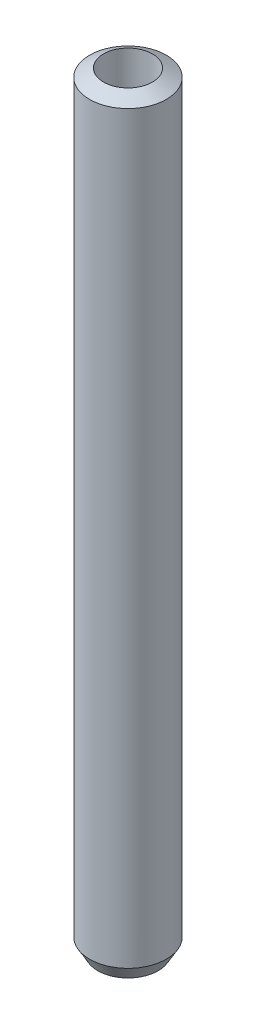
ISO-10303-21;
HEADER;
FILE_DESCRIPTION(('STEP AP214'),'2;1');
FILE_NAME('part.step','',(''),(''),'','','');
FILE_SCHEMA(('AUTOMOTIVE_DESIGN { 1 0 10303 214 1 1 1 1 }'));
ENDSEC;
DATA;
#1=APPLICATION_CONTEXT('core data for automotive mechanical design processes');
#2=APPLICATION_PROTOCOL_DEFINITION('international standard','automotive_design',2000,#1);
#3=PRODUCT_CONTEXT('',#1,'mechanical');
#4=PRODUCT('Part','Part','',(#3));
#5=PRODUCT_RELATED_PRODUCT_CATEGORY('part','',(#4));
#6=PRODUCT_DEFINITION_FORMATION('','',#4);
#7=PRODUCT_DEFINITION_CONTEXT('part definition',#1,'design');
#8=PRODUCT_DEFINITION('design','',#6,#7);
#9=PRODUCT_DEFINITION_SHAPE('','',#8);
#10=(LENGTH_UNIT() NAMED_UNIT(*) SI_UNIT(.MILLI.,.METRE.));
#11=(NAMED_UNIT(*) PLANE_ANGLE_UNIT() SI_UNIT($,.RADIAN.));
#12=(NAMED_UNIT(*) SI_UNIT($,.STERADIAN.) SOLID_ANGLE_UNIT());
#13=UNCERTAINTY_MEASURE_WITH_UNIT(LENGTH_MEASURE(1.E-05),#10,'distance_accuracy_value','');
#14=(GEOMETRIC_REPRESENTATION_CONTEXT(3) GLOBAL_UNCERTAINTY_ASSIGNED_CONTEXT((#13)) GLOBAL_UNIT_ASSIGNED_CONTEXT((#10,
#11,#12)) REPRESENTATION_CONTEXT('',''));
#15=CARTESIAN_POINT('',(0.,0.,0.));
#16=DIRECTION('',(0.,0.,1.));
#17=DIRECTION('',(1.,0.,0.));
#18=AXIS2_PLACEMENT_3D('',#15,#16,#17);
#19=CARTESIAN_POINT('',(0.,299.717100762352,0.));
#20=DIRECTION('',(0.,-1.,0.));
#21=DIRECTION('',(0.,0.,-1.));
#22=AXIS2_PLACEMENT_3D('',#19,#20,#21);
#23=CYLINDRICAL_SURFACE('',#22,15.);
#24=CARTESIAN_POINT('',(0.,296.530951161692,0.));
#25=DIRECTION('',(0.,1.,0.));
#26=DIRECTION('',(0.,0.,1.));
#27=AXIS2_PLACEMENT_3D('',#24,#25,#26);
#28=CIRCLE('',#27,15.);
#29=CARTESIAN_POINT('',(0.,296.530951161692,15.));
#30=VERTEX_POINT('',#29);
#31=EDGE_CURVE('E50',#30,#30,#28,.F.);
#32=ORIENTED_EDGE('',*,*,#31,.T.);
#33=EDGE_LOOP('',(#32));
#34=FACE_BOUND('',#33,.T.);
#35=CARTESIAN_POINT('',(0.,5.51857298885822,0.));
#36=DIRECTION('',(0.,1.,0.));
#37=DIRECTION('',(0.,0.,1.));
#38=AXIS2_PLACEMENT_3D('',#35,#36,#37);
#39=CIRCLE('',#38,15.);
#40=CARTESIAN_POINT('',(0.,5.51857298885822,15.));
#41=VERTEX_POINT('',#40);
#42=EDGE_CURVE('E51',#41,#41,#39,.T.);
#43=ORIENTED_EDGE('',*,*,#42,.T.);
#44=EDGE_LOOP('',(#43));
#45=FACE_BOUND('',#44,.T.);
#46=ADVANCED_FACE('F39',(#34,#45),#23,.T.);
#47=CARTESIAN_POINT('',(0.,0.,0.));
#48=DIRECTION('',(0.,1.,0.));
#49=DIRECTION('',(0.,0.,1.));
#50=AXIS2_PLACEMENT_3D('',#47,#48,#49);
#51=PLANE('',#50);
#52=CARTESIAN_POINT('',(0.,0.,0.));
#53=DIRECTION('',(0.,1.,0.));
#54=DIRECTION('',(0.,0.,1.));
#55=AXIS2_PLACEMENT_3D('',#52,#53,#54);
#56=CIRCLE('',#55,11.8138503993401);
#57=CARTESIAN_POINT('',(0.,0.,11.8138503993401));
#58=VERTEX_POINT('',#57);
#59=EDGE_CURVE('E10',#58,#58,#56,.F.);
#60=ORIENTED_EDGE('',*,*,#59,.T.);
#61=EDGE_LOOP('',(#60));
#62=FACE_BOUND('',#61,.T.);
#63=CARTESIAN_POINT('',(0.,0.,0.));
#64=DIRECTION('',(0.,1.,0.));
#65=DIRECTION('',(0.,0.,1.));
#66=AXIS2_PLACEMENT_3D('',#63,#64,#65);
#67=CIRCLE('',#66,9.55557549402518);
#68=CARTESIAN_POINT('',(0.,0.,9.55557549402518));
#69=VERTEX_POINT('',#68);
#70=EDGE_CURVE('E58',#69,#69,#67,.T.);
#71=ORIENTED_EDGE('',*,*,#70,.T.);
#72=EDGE_LOOP('',(#71));
#73=FACE_BOUND('',#72,.T.);
#74=ADVANCED_FACE('F62',(#62,#73),#51,.F.);
#75=CARTESIAN_POINT('',(0.,299.717100762352,0.));
#76=DIRECTION('',(0.,-1.,0.));
#77=DIRECTION('',(0.,0.,-1.));
#78=AXIS2_PLACEMENT_3D('',#75,#76,#77);
#79=CYLINDRICAL_SURFACE('',#78,9.55557549402518);
#80=CARTESIAN_POINT('',(0.,299.6742911158,0.));
#81=DIRECTION('',(0.,-1.,0.));
#82=DIRECTION('',(0.,0.,-1.));
#83=AXIS2_PLACEMENT_3D('',#80,#81,#82);
#84=CIRCLE('',#83,9.55557549402518);
#85=CARTESIAN_POINT('',(0.,299.6742911158,-9.55557549402518));
#86=VERTEX_POINT('',#85);
#87=EDGE_CURVE('E54',#86,#86,#84,.F.);
#88=ORIENTED_EDGE('',*,*,#87,.T.);
#89=EDGE_LOOP('',(#88));
#90=FACE_BOUND('',#89,.T.);
#91=ORIENTED_EDGE('',*,*,#70,.F.);
#92=EDGE_LOOP('',(#91));
#93=FACE_BOUND('',#92,.T.);
#94=ADVANCED_FACE('F68',(#90,#93),#79,.F.);
#95=CARTESIAN_POINT('',(0.,299.717100762352,0.));
#96=DIRECTION('',(0.,-1.,0.));
#97=DIRECTION('',(0.,0.,-1.));
#98=AXIS2_PLACEMENT_3D('',#95,#96,#97);
#99=CONICAL_SURFACE('',#98,9.48142701114176,1.0471975511966);
#100=ORIENTED_EDGE('',*,*,#31,.F.);
#101=EDGE_LOOP('',(#100));
#102=FACE_BOUND('',#101,.T.);
#103=ORIENTED_EDGE('',*,*,#87,.F.);
#104=EDGE_LOOP('',(#103));
#105=FACE_BOUND('',#104,.T.);
#106=ADVANCED_FACE('F66',(#102,#105),#99,.T.);
#107=CARTESIAN_POINT('',(0.,5.51857298885822,0.));
#108=DIRECTION('',(0.,1.,0.));
#109=DIRECTION('',(0.,0.,1.));
#110=AXIS2_PLACEMENT_3D('',#107,#108,#109);
#111=CONICAL_SURFACE('',#110,15.,0.523598775598304);
#112=ORIENTED_EDGE('',*,*,#59,.F.);
#113=EDGE_LOOP('',(#112));
#114=FACE_BOUND('',#113,.T.);
#115=ORIENTED_EDGE('',*,*,#42,.F.);
#116=EDGE_LOOP('',(#115));
#117=FACE_BOUND('',#116,.T.);
#118=ADVANCED_FACE('F45',(#114,#117),#111,.T.);
#119=CLOSED_SHELL('',(#46,#74,#94,#106,#118));
#120=MANIFOLD_SOLID_BREP('B2',#119);
#121=ADVANCED_BREP_SHAPE_REPRESENTATION('',(#18,#120),#14);
#122=SHAPE_DEFINITION_REPRESENTATION(#9,#121);
ENDSEC;
END-ISO-10303-21;
